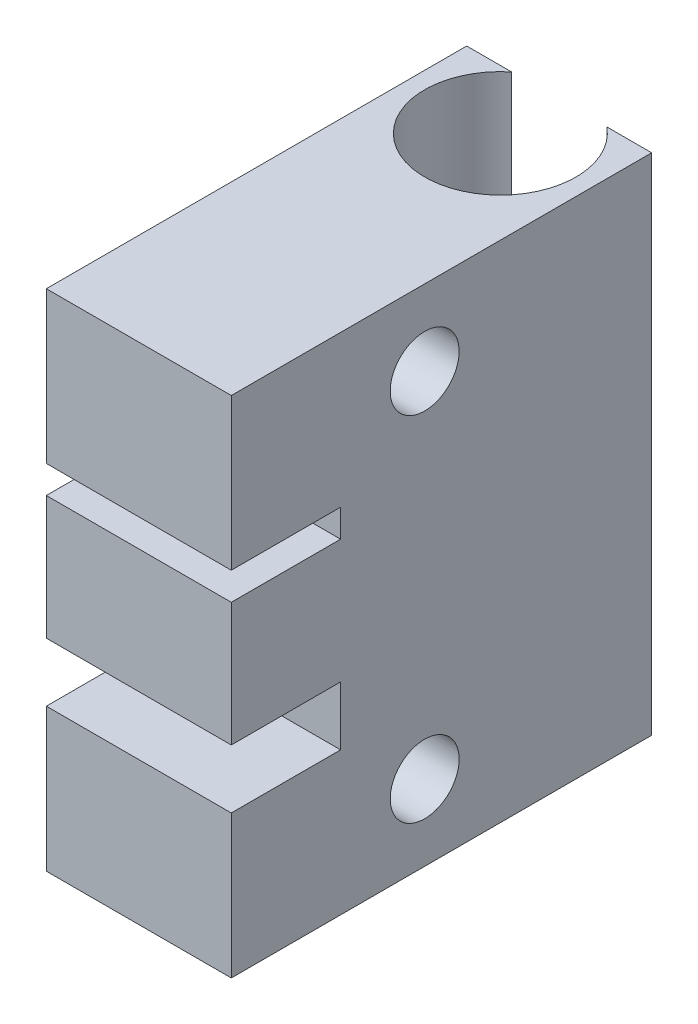
ISO-10303-21;
HEADER;
FILE_DESCRIPTION(('STEP AP214'),'2;1');
FILE_NAME('part.step','',(''),(''),'','','');
FILE_SCHEMA(('AUTOMOTIVE_DESIGN { 1 0 10303 214 1 1 1 1 }'));
ENDSEC;
DATA;
#1=APPLICATION_CONTEXT('core data for automotive mechanical design processes');
#2=APPLICATION_PROTOCOL_DEFINITION('international standard','automotive_design',2000,#1);
#3=PRODUCT_CONTEXT('',#1,'mechanical');
#4=PRODUCT('Part','Part','',(#3));
#5=PRODUCT_RELATED_PRODUCT_CATEGORY('part','',(#4));
#6=PRODUCT_DEFINITION_FORMATION('','',#4);
#7=PRODUCT_DEFINITION_CONTEXT('part definition',#1,'design');
#8=PRODUCT_DEFINITION('design','',#6,#7);
#9=PRODUCT_DEFINITION_SHAPE('','',#8);
#10=(LENGTH_UNIT() NAMED_UNIT(*) SI_UNIT(.MILLI.,.METRE.));
#11=(NAMED_UNIT(*) PLANE_ANGLE_UNIT() SI_UNIT($,.RADIAN.));
#12=(NAMED_UNIT(*) SI_UNIT($,.STERADIAN.) SOLID_ANGLE_UNIT());
#13=UNCERTAINTY_MEASURE_WITH_UNIT(LENGTH_MEASURE(1.E-05),#10,'distance_accuracy_value','');
#14=(GEOMETRIC_REPRESENTATION_CONTEXT(3) GLOBAL_UNCERTAINTY_ASSIGNED_CONTEXT((#13)) GLOBAL_UNIT_ASSIGNED_CONTEXT((#10,
#11,#12)) REPRESENTATION_CONTEXT('',''));
#15=CARTESIAN_POINT('',(0.,0.,0.));
#16=DIRECTION('',(0.,0.,1.));
#17=DIRECTION('',(1.,0.,0.));
#18=AXIS2_PLACEMENT_3D('',#15,#16,#17);
#19=CARTESIAN_POINT('',(11.,60.,25.));
#20=DIRECTION('',(0.,0.,-1.));
#21=DIRECTION('',(-1.,0.,0.));
#22=AXIS2_PLACEMENT_3D('',#19,#20,#21);
#23=PLANE('',#22);
#24=DIRECTION('',(0.,-1.,0.));
#25=VECTOR('',#24,1.);
#26=CARTESIAN_POINT('',(-11.,60.,25.));
#27=LINE('',#26,#25);
#28=CARTESIAN_POINT('',(-11.,38.7,25.));
#29=VERTEX_POINT('',#28);
#30=CARTESIAN_POINT('',(-11.,24.,25.));
#31=VERTEX_POINT('',#30);
#32=EDGE_CURVE('E237',#29,#31,#27,.T.);
#33=ORIENTED_EDGE('',*,*,#32,.T.);
#34=DIRECTION('',(-1.,0.,0.));
#35=VECTOR('',#34,1.);
#36=CARTESIAN_POINT('',(-11.,24.,25.));
#37=LINE('',#36,#35);
#38=CARTESIAN_POINT('',(11.,24.,25.));
#39=VERTEX_POINT('',#38);
#40=EDGE_CURVE('E148',#39,#31,#37,.T.);
#41=ORIENTED_EDGE('',*,*,#40,.F.);
#42=DIRECTION('',(0.,-1.,0.));
#43=VECTOR('',#42,1.);
#44=CARTESIAN_POINT('',(11.,60.,25.));
#45=LINE('',#44,#43);
#46=CARTESIAN_POINT('',(11.,38.7,25.));
#47=VERTEX_POINT('',#46);
#48=EDGE_CURVE('E232',#47,#39,#45,.T.);
#49=ORIENTED_EDGE('',*,*,#48,.F.);
#50=DIRECTION('',(1.,0.,0.));
#51=VECTOR('',#50,1.);
#52=CARTESIAN_POINT('',(-11.,38.7,25.));
#53=LINE('',#52,#51);
#54=EDGE_CURVE('E172',#29,#47,#53,.T.);
#55=ORIENTED_EDGE('',*,*,#54,.F.);
#56=EDGE_LOOP('',(#33,#41,#49,#55));
#57=FACE_BOUND('',#56,.T.);
#58=ADVANCED_FACE('F33',(#57),#23,.F.);
#59=CARTESIAN_POINT('',(-11.,60.,25.));
#60=VERTEX_POINT('',#59);
#61=CARTESIAN_POINT('',(-11.,42.,25.));
#62=VERTEX_POINT('',#61);
#63=EDGE_CURVE('E233',#60,#62,#27,.T.);
#64=ORIENTED_EDGE('',*,*,#63,.T.);
#65=DIRECTION('',(-1.,0.,0.));
#66=VECTOR('',#65,1.);
#67=CARTESIAN_POINT('',(-11.,42.,25.));
#68=LINE('',#67,#66);
#69=CARTESIAN_POINT('',(11.,42.,25.));
#70=VERTEX_POINT('',#69);
#71=EDGE_CURVE('E164',#70,#62,#68,.T.);
#72=ORIENTED_EDGE('',*,*,#71,.F.);
#73=CARTESIAN_POINT('',(11.,60.,25.));
#74=VERTEX_POINT('',#73);
#75=EDGE_CURVE('E229',#74,#70,#45,.T.);
#76=ORIENTED_EDGE('',*,*,#75,.F.);
#77=DIRECTION('',(1.,0.,0.));
#78=VECTOR('',#77,1.);
#79=CARTESIAN_POINT('',(11.,60.,25.));
#80=LINE('',#79,#78);
#81=EDGE_CURVE('E216',#60,#74,#80,.T.);
#82=ORIENTED_EDGE('',*,*,#81,.F.);
#83=EDGE_LOOP('',(#64,#72,#76,#82));
#84=FACE_BOUND('',#83,.T.);
#85=ADVANCED_FACE('F272',(#84),#23,.F.);
#86=CARTESIAN_POINT('',(11.,60.,-25.));
#87=DIRECTION('',(0.,0.,1.));
#88=DIRECTION('',(1.,0.,0.));
#89=AXIS2_PLACEMENT_3D('',#86,#87,#88);
#90=PLANE('',#89);
#91=DIRECTION('',(-1.,0.,0.));
#92=VECTOR('',#91,1.);
#93=CARTESIAN_POINT('',(11.,0.,-25.));
#94=LINE('',#93,#92);
#95=CARTESIAN_POINT('',(11.,0.,-25.));
#96=VERTEX_POINT('',#95);
#97=CARTESIAN_POINT('',(5.65685424949238,0.,-25.));
#98=VERTEX_POINT('',#97);
#99=EDGE_CURVE('E222',#96,#98,#94,.T.);
#100=ORIENTED_EDGE('',*,*,#99,.T.);
#101=DIRECTION('',(0.,1.,0.));
#102=VECTOR('',#101,1.);
#103=CARTESIAN_POINT('',(5.65685424949238,0.,-25.));
#104=LINE('',#103,#102);
#105=CARTESIAN_POINT('',(5.65685424949238,60.,-25.));
#106=VERTEX_POINT('',#105);
#107=EDGE_CURVE('E190',#98,#106,#104,.T.);
#108=ORIENTED_EDGE('',*,*,#107,.T.);
#109=DIRECTION('',(-1.,0.,0.));
#110=VECTOR('',#109,1.);
#111=CARTESIAN_POINT('',(11.,60.,-25.));
#112=LINE('',#111,#110);
#113=CARTESIAN_POINT('',(11.,60.,-25.));
#114=VERTEX_POINT('',#113);
#115=EDGE_CURVE('E211',#114,#106,#112,.T.);
#116=ORIENTED_EDGE('',*,*,#115,.F.);
#117=DIRECTION('',(0.,-1.,0.));
#118=VECTOR('',#117,1.);
#119=CARTESIAN_POINT('',(11.,60.,-25.));
#120=LINE('',#119,#118);
#121=EDGE_CURVE('E41',#114,#96,#120,.T.);
#122=ORIENTED_EDGE('',*,*,#121,.T.);
#123=EDGE_LOOP('',(#100,#108,#116,#122));
#124=FACE_BOUND('',#123,.T.);
#125=ADVANCED_FACE('F242',(#124),#90,.F.);
#126=CARTESIAN_POINT('',(11.,60.,-25.));
#127=DIRECTION('',(-1.,0.,0.));
#128=DIRECTION('',(0.,0.,1.));
#129=AXIS2_PLACEMENT_3D('',#126,#127,#128);
#130=PLANE('',#129);
#131=ORIENTED_EDGE('',*,*,#48,.T.);
#132=DIRECTION('',(0.,0.,1.));
#133=VECTOR('',#132,1.);
#134=CARTESIAN_POINT('',(11.,24.,12.));
#135=LINE('',#134,#133);
#136=CARTESIAN_POINT('',(11.,24.,12.));
#137=VERTEX_POINT('',#136);
#138=EDGE_CURVE('E155',#137,#39,#135,.T.);
#139=ORIENTED_EDGE('',*,*,#138,.F.);
#140=DIRECTION('',(0.,1.,0.));
#141=VECTOR('',#140,1.);
#142=CARTESIAN_POINT('',(11.,24.,12.));
#143=LINE('',#142,#141);
#144=CARTESIAN_POINT('',(11.,17.,12.));
#145=VERTEX_POINT('',#144);
#146=EDGE_CURVE('E138',#145,#137,#143,.T.);
#147=ORIENTED_EDGE('',*,*,#146,.F.);
#148=DIRECTION('',(0.,0.,1.));
#149=VECTOR('',#148,1.);
#150=CARTESIAN_POINT('',(11.,17.,12.));
#151=LINE('',#150,#149);
#152=CARTESIAN_POINT('',(11.,17.,25.));
#153=VERTEX_POINT('',#152);
#154=EDGE_CURVE('E135',#145,#153,#151,.T.);
#155=ORIENTED_EDGE('',*,*,#154,.T.);
#156=CARTESIAN_POINT('',(11.,0.,25.));
#157=VERTEX_POINT('',#156);
#158=EDGE_CURVE('E218',#153,#157,#45,.T.);
#159=ORIENTED_EDGE('',*,*,#158,.T.);
#160=DIRECTION('',(0.,0.,-1.));
#161=VECTOR('',#160,1.);
#162=CARTESIAN_POINT('',(11.,0.,-25.));
#163=LINE('',#162,#161);
#164=EDGE_CURVE('E203',#157,#96,#163,.T.);
#165=ORIENTED_EDGE('',*,*,#164,.T.);
#166=ORIENTED_EDGE('',*,*,#121,.F.);
#167=DIRECTION('',(0.,0.,-1.));
#168=VECTOR('',#167,1.);
#169=CARTESIAN_POINT('',(11.,60.,-25.));
#170=LINE('',#169,#168);
#171=EDGE_CURVE('E206',#74,#114,#170,.T.);
#172=ORIENTED_EDGE('',*,*,#171,.F.);
#173=ORIENTED_EDGE('',*,*,#75,.T.);
#174=DIRECTION('',(0.,0.,1.));
#175=VECTOR('',#174,1.);
#176=CARTESIAN_POINT('',(11.,42.,12.));
#177=LINE('',#176,#175);
#178=CARTESIAN_POINT('',(11.,42.,12.));
#179=VERTEX_POINT('',#178);
#180=EDGE_CURVE('E180',#179,#70,#177,.T.);
#181=ORIENTED_EDGE('',*,*,#180,.F.);
#182=DIRECTION('',(0.,1.,0.));
#183=VECTOR('',#182,1.);
#184=CARTESIAN_POINT('',(11.,42.,12.));
#185=LINE('',#184,#183);
#186=CARTESIAN_POINT('',(11.,38.7,12.));
#187=VERTEX_POINT('',#186);
#188=EDGE_CURVE('E167',#187,#179,#185,.T.);
#189=ORIENTED_EDGE('',*,*,#188,.F.);
#190=DIRECTION('',(0.,0.,1.));
#191=VECTOR('',#190,1.);
#192=CARTESIAN_POINT('',(11.,38.7,12.));
#193=LINE('',#192,#191);
#194=EDGE_CURVE('E182',#187,#47,#193,.T.);
#195=ORIENTED_EDGE('',*,*,#194,.T.);
#196=EDGE_LOOP('',(#131,#139,#147,#155,#159,#165,#166,#172,#173,#181,#189,#195));
#197=FACE_BOUND('',#196,.T.);
#198=CARTESIAN_POINT('',(11.,9.,1.99999999999999));
#199=DIRECTION('',(1.,0.,0.));
#200=DIRECTION('',(0.,0.,-1.));
#201=AXIS2_PLACEMENT_3D('',#198,#199,#200);
#202=CIRCLE('',#201,4.1);
#203=CARTESIAN_POINT('',(11.,9.,-2.10000000000001));
#204=VERTEX_POINT('',#203);
#205=EDGE_CURVE('E193',#204,#204,#202,.T.);
#206=ORIENTED_EDGE('',*,*,#205,.F.);
#207=EDGE_LOOP('',(#206));
#208=FACE_BOUND('',#207,.T.);
#209=CARTESIAN_POINT('',(11.,51.,1.99999999999999));
#210=DIRECTION('',(1.,0.,0.));
#211=DIRECTION('',(0.,0.,-1.));
#212=AXIS2_PLACEMENT_3D('',#209,#210,#211);
#213=CIRCLE('',#212,4.1);
#214=CARTESIAN_POINT('',(11.,51.,-2.10000000000001));
#215=VERTEX_POINT('',#214);
#216=EDGE_CURVE('E197',#215,#215,#213,.T.);
#217=ORIENTED_EDGE('',*,*,#216,.F.);
#218=EDGE_LOOP('',(#217));
#219=FACE_BOUND('',#218,.T.);
#220=ADVANCED_FACE('F35',(#197,#208,#219),#130,.F.);
#221=CARTESIAN_POINT('',(-5.65685424949238,60.,-25.));
#222=VERTEX_POINT('',#221);
#223=CARTESIAN_POINT('',(-11.,60.,-25.));
#224=VERTEX_POINT('',#223);
#225=EDGE_CURVE('E209',#222,#224,#112,.T.);
#226=ORIENTED_EDGE('',*,*,#225,.F.);
#227=DIRECTION('',(0.,1.,0.));
#228=VECTOR('',#227,1.);
#229=CARTESIAN_POINT('',(-5.65685424949238,0.,-25.));
#230=LINE('',#229,#228);
#231=CARTESIAN_POINT('',(-5.65685424949238,0.,-25.));
#232=VERTEX_POINT('',#231);
#233=EDGE_CURVE('E187',#222,#232,#230,.F.);
#234=ORIENTED_EDGE('',*,*,#233,.T.);
#235=CARTESIAN_POINT('',(-11.,0.,-25.));
#236=VERTEX_POINT('',#235);
#237=EDGE_CURVE('E221',#232,#236,#94,.T.);
#238=ORIENTED_EDGE('',*,*,#237,.T.);
#239=DIRECTION('',(0.,-1.,0.));
#240=VECTOR('',#239,1.);
#241=CARTESIAN_POINT('',(-11.,60.,-25.));
#242=LINE('',#241,#240);
#243=EDGE_CURVE('E236',#224,#236,#242,.T.);
#244=ORIENTED_EDGE('',*,*,#243,.F.);
#245=EDGE_LOOP('',(#226,#234,#238,#244));
#246=FACE_BOUND('',#245,.T.);
#247=ADVANCED_FACE('F260',(#246),#90,.F.);
#248=CARTESIAN_POINT('',(-11.,60.,-25.));
#249=DIRECTION('',(1.,0.,0.));
#250=DIRECTION('',(0.,0.,-1.));
#251=AXIS2_PLACEMENT_3D('',#248,#249,#250);
#252=PLANE('',#251);
#253=CARTESIAN_POINT('',(-11.,9.,2.));
#254=DIRECTION('',(1.,0.,0.));
#255=DIRECTION('',(0.,0.,-1.));
#256=AXIS2_PLACEMENT_3D('',#253,#254,#255);
#257=CIRCLE('',#256,4.1);
#258=CARTESIAN_POINT('',(-11.,9.,-2.1));
#259=VERTEX_POINT('',#258);
#260=EDGE_CURVE('E194',#259,#259,#257,.T.);
#261=ORIENTED_EDGE('',*,*,#260,.T.);
#262=EDGE_LOOP('',(#261));
#263=FACE_BOUND('',#262,.T.);
#264=CARTESIAN_POINT('',(-11.,51.,2.));
#265=DIRECTION('',(1.,0.,0.));
#266=DIRECTION('',(0.,0.,-1.));
#267=AXIS2_PLACEMENT_3D('',#264,#265,#266);
#268=CIRCLE('',#267,4.1);
#269=CARTESIAN_POINT('',(-11.,51.,-2.1));
#270=VERTEX_POINT('',#269);
#271=EDGE_CURVE('E200',#270,#270,#268,.T.);
#272=ORIENTED_EDGE('',*,*,#271,.T.);
#273=EDGE_LOOP('',(#272));
#274=FACE_BOUND('',#273,.T.);
#275=DIRECTION('',(0.,-1.,0.));
#276=VECTOR('',#275,1.);
#277=CARTESIAN_POINT('',(-11.,24.,12.));
#278=LINE('',#277,#276);
#279=CARTESIAN_POINT('',(-11.,24.,12.));
#280=VERTEX_POINT('',#279);
#281=CARTESIAN_POINT('',(-11.,17.,12.));
#282=VERTEX_POINT('',#281);
#283=EDGE_CURVE('E139',#280,#282,#278,.T.);
#284=ORIENTED_EDGE('',*,*,#283,.F.);
#285=DIRECTION('',(0.,0.,1.));
#286=VECTOR('',#285,1.);
#287=CARTESIAN_POINT('',(-11.,24.,12.));
#288=LINE('',#287,#286);
#289=EDGE_CURVE('E174',#280,#31,#288,.T.);
#290=ORIENTED_EDGE('',*,*,#289,.T.);
#291=ORIENTED_EDGE('',*,*,#32,.F.);
#292=DIRECTION('',(0.,0.,1.));
#293=VECTOR('',#292,1.);
#294=CARTESIAN_POINT('',(-11.,38.7,12.));
#295=LINE('',#294,#293);
#296=CARTESIAN_POINT('',(-11.,38.7,12.));
#297=VERTEX_POINT('',#296);
#298=EDGE_CURVE('E56',#297,#29,#295,.T.);
#299=ORIENTED_EDGE('',*,*,#298,.F.);
#300=DIRECTION('',(0.,-1.,0.));
#301=VECTOR('',#300,1.);
#302=CARTESIAN_POINT('',(-11.,42.,12.));
#303=LINE('',#302,#301);
#304=CARTESIAN_POINT('',(-11.,42.,12.));
#305=VERTEX_POINT('',#304);
#306=EDGE_CURVE('E160',#305,#297,#303,.T.);
#307=ORIENTED_EDGE('',*,*,#306,.F.);
#308=DIRECTION('',(0.,0.,1.));
#309=VECTOR('',#308,1.);
#310=CARTESIAN_POINT('',(-11.,42.,12.));
#311=LINE('',#310,#309);
#312=EDGE_CURVE('E176',#305,#62,#311,.T.);
#313=ORIENTED_EDGE('',*,*,#312,.T.);
#314=ORIENTED_EDGE('',*,*,#63,.F.);
#315=DIRECTION('',(0.,0.,1.));
#316=VECTOR('',#315,1.);
#317=CARTESIAN_POINT('',(-11.,60.,-25.));
#318=LINE('',#317,#316);
#319=EDGE_CURVE('E214',#224,#60,#318,.T.);
#320=ORIENTED_EDGE('',*,*,#319,.F.);
#321=ORIENTED_EDGE('',*,*,#243,.T.);
#322=DIRECTION('',(0.,0.,1.));
#323=VECTOR('',#322,1.);
#324=CARTESIAN_POINT('',(-11.,0.,-25.));
#325=LINE('',#324,#323);
#326=CARTESIAN_POINT('',(-11.,0.,25.));
#327=VERTEX_POINT('',#326);
#328=EDGE_CURVE('E225',#236,#327,#325,.T.);
#329=ORIENTED_EDGE('',*,*,#328,.T.);
#330=CARTESIAN_POINT('',(-11.,17.,25.));
#331=VERTEX_POINT('',#330);
#332=EDGE_CURVE('E153',#331,#327,#27,.T.);
#333=ORIENTED_EDGE('',*,*,#332,.F.);
#334=DIRECTION('',(0.,0.,1.));
#335=VECTOR('',#334,1.);
#336=CARTESIAN_POINT('',(-11.,17.,12.));
#337=LINE('',#336,#335);
#338=EDGE_CURVE('E48',#282,#331,#337,.T.);
#339=ORIENTED_EDGE('',*,*,#338,.F.);
#340=EDGE_LOOP('',(#284,#290,#291,#299,#307,#313,#314,#320,#321,#329,#333,#339));
#341=FACE_BOUND('',#340,.T.);
#342=ADVANCED_FACE('F151',(#263,#274,#341),#252,.F.);
#343=ORIENTED_EDGE('',*,*,#158,.F.);
#344=DIRECTION('',(1.,0.,0.));
#345=VECTOR('',#344,1.);
#346=CARTESIAN_POINT('',(-11.,17.,25.));
#347=LINE('',#346,#345);
#348=EDGE_CURVE('E286',#331,#153,#347,.T.);
#349=ORIENTED_EDGE('',*,*,#348,.F.);
#350=ORIENTED_EDGE('',*,*,#332,.T.);
#351=DIRECTION('',(1.,0.,0.));
#352=VECTOR('',#351,1.);
#353=CARTESIAN_POINT('',(11.,0.,25.));
#354=LINE('',#353,#352);
#355=EDGE_CURVE('E210',#327,#157,#354,.T.);
#356=ORIENTED_EDGE('',*,*,#355,.T.);
#357=EDGE_LOOP('',(#343,#349,#350,#356));
#358=FACE_BOUND('',#357,.T.);
#359=ADVANCED_FACE('F293',(#358),#23,.F.);
#360=CARTESIAN_POINT('',(11.,60.,25.));
#361=DIRECTION('',(0.,-1.,0.));
#362=DIRECTION('',(0.,0.,-1.));
#363=AXIS2_PLACEMENT_3D('',#360,#361,#362);
#364=PLANE('',#363);
#365=ORIENTED_EDGE('',*,*,#115,.T.);
#366=CARTESIAN_POINT('',(0.,60.,-18.));
#367=DIRECTION('',(0.,1.,0.));
#368=DIRECTION('',(0.,0.,1.));
#369=AXIS2_PLACEMENT_3D('',#366,#367,#368);
#370=CIRCLE('',#369,9.);
#371=EDGE_CURVE('E179',#222,#106,#370,.T.);
#372=ORIENTED_EDGE('',*,*,#371,.F.);
#373=ORIENTED_EDGE('',*,*,#225,.T.);
#374=ORIENTED_EDGE('',*,*,#319,.T.);
#375=ORIENTED_EDGE('',*,*,#81,.T.);
#376=ORIENTED_EDGE('',*,*,#171,.T.);
#377=EDGE_LOOP('',(#365,#372,#373,#374,#375,#376));
#378=FACE_BOUND('',#377,.T.);
#379=ADVANCED_FACE('F264',(#378),#364,.F.);
#380=CARTESIAN_POINT('',(11.,0.,25.));
#381=DIRECTION('',(0.,-1.,0.));
#382=DIRECTION('',(0.,0.,-1.));
#383=AXIS2_PLACEMENT_3D('',#380,#381,#382);
#384=PLANE('',#383);
#385=CARTESIAN_POINT('',(0.,0.,-18.));
#386=DIRECTION('',(0.,-1.,0.));
#387=DIRECTION('',(0.,0.,-1.));
#388=AXIS2_PLACEMENT_3D('',#385,#386,#387);
#389=CIRCLE('',#388,9.);
#390=EDGE_CURVE('E11',#98,#232,#389,.T.);
#391=ORIENTED_EDGE('',*,*,#390,.F.);
#392=ORIENTED_EDGE('',*,*,#99,.F.);
#393=ORIENTED_EDGE('',*,*,#164,.F.);
#394=ORIENTED_EDGE('',*,*,#355,.F.);
#395=ORIENTED_EDGE('',*,*,#328,.F.);
#396=ORIENTED_EDGE('',*,*,#237,.F.);
#397=EDGE_LOOP('',(#391,#392,#393,#394,#395,#396));
#398=FACE_BOUND('',#397,.T.);
#399=ADVANCED_FACE('F252',(#398),#384,.T.);
#400=CARTESIAN_POINT('',(-11.,51.,2.));
#401=DIRECTION('',(1.,0.,0.));
#402=DIRECTION('',(0.,0.,-1.));
#403=AXIS2_PLACEMENT_3D('',#400,#401,#402);
#404=CYLINDRICAL_SURFACE('',#403,4.1);
#405=ORIENTED_EDGE('',*,*,#271,.F.);
#406=EDGE_LOOP('',(#405));
#407=FACE_BOUND('',#406,.T.);
#408=ORIENTED_EDGE('',*,*,#216,.T.);
#409=EDGE_LOOP('',(#408));
#410=FACE_BOUND('',#409,.T.);
#411=ADVANCED_FACE('F389',(#407,#410),#404,.F.);
#412=CARTESIAN_POINT('',(-11.,9.,2.));
#413=DIRECTION('',(1.,0.,0.));
#414=DIRECTION('',(0.,0.,-1.));
#415=AXIS2_PLACEMENT_3D('',#412,#413,#414);
#416=CYLINDRICAL_SURFACE('',#415,4.1);
#417=ORIENTED_EDGE('',*,*,#260,.F.);
#418=EDGE_LOOP('',(#417));
#419=FACE_BOUND('',#418,.T.);
#420=ORIENTED_EDGE('',*,*,#205,.T.);
#421=EDGE_LOOP('',(#420));
#422=FACE_BOUND('',#421,.T.);
#423=ADVANCED_FACE('F386',(#419,#422),#416,.F.);
#424=CARTESIAN_POINT('',(0.,0.,-18.));
#425=DIRECTION('',(0.,1.,0.));
#426=DIRECTION('',(0.,0.,1.));
#427=AXIS2_PLACEMENT_3D('',#424,#425,#426);
#428=CYLINDRICAL_SURFACE('',#427,9.);
#429=ORIENTED_EDGE('',*,*,#390,.T.);
#430=ORIENTED_EDGE('',*,*,#233,.F.);
#431=ORIENTED_EDGE('',*,*,#371,.T.);
#432=ORIENTED_EDGE('',*,*,#107,.F.);
#433=EDGE_LOOP('',(#429,#430,#431,#432));
#434=FACE_BOUND('',#433,.T.);
#435=ADVANCED_FACE('F256',(#434),#428,.F.);
#436=CARTESIAN_POINT('',(-11.,42.,12.));
#437=DIRECTION('',(0.,1.,0.));
#438=DIRECTION('',(0.,0.,1.));
#439=AXIS2_PLACEMENT_3D('',#436,#437,#438);
#440=PLANE('',#439);
#441=ORIENTED_EDGE('',*,*,#71,.T.);
#442=ORIENTED_EDGE('',*,*,#312,.F.);
#443=DIRECTION('',(-1.,0.,0.));
#444=VECTOR('',#443,1.);
#445=CARTESIAN_POINT('',(-11.,42.,12.));
#446=LINE('',#445,#444);
#447=EDGE_CURVE('E169',#179,#305,#446,.T.);
#448=ORIENTED_EDGE('',*,*,#447,.F.);
#449=ORIENTED_EDGE('',*,*,#180,.T.);
#450=EDGE_LOOP('',(#441,#442,#448,#449));
#451=FACE_BOUND('',#450,.T.);
#452=ADVANCED_FACE('F274',(#451),#440,.F.);
#453=CARTESIAN_POINT('',(-11.,38.7,12.));
#454=DIRECTION('',(0.,-1.,0.));
#455=DIRECTION('',(0.,0.,-1.));
#456=AXIS2_PLACEMENT_3D('',#453,#454,#455);
#457=PLANE('',#456);
#458=ORIENTED_EDGE('',*,*,#54,.T.);
#459=ORIENTED_EDGE('',*,*,#194,.F.);
#460=DIRECTION('',(1.,0.,0.));
#461=VECTOR('',#460,1.);
#462=CARTESIAN_POINT('',(-11.,38.7,12.));
#463=LINE('',#462,#461);
#464=EDGE_CURVE('E163',#297,#187,#463,.T.);
#465=ORIENTED_EDGE('',*,*,#464,.F.);
#466=ORIENTED_EDGE('',*,*,#298,.T.);
#467=EDGE_LOOP('',(#458,#459,#465,#466));
#468=FACE_BOUND('',#467,.T.);
#469=ADVANCED_FACE('F338',(#468),#457,.F.);
#470=CARTESIAN_POINT('',(0.,0.,12.));
#471=DIRECTION('',(0.,0.,1.));
#472=DIRECTION('',(1.,0.,0.));
#473=AXIS2_PLACEMENT_3D('',#470,#471,#472);
#474=PLANE('',#473);
#475=ORIENTED_EDGE('',*,*,#306,.T.);
#476=ORIENTED_EDGE('',*,*,#464,.T.);
#477=ORIENTED_EDGE('',*,*,#188,.T.);
#478=ORIENTED_EDGE('',*,*,#447,.T.);
#479=EDGE_LOOP('',(#475,#476,#477,#478));
#480=FACE_BOUND('',#479,.T.);
#481=ADVANCED_FACE('F279',(#480),#474,.T.);
#482=CARTESIAN_POINT('',(-11.,24.,12.));
#483=DIRECTION('',(0.,1.,0.));
#484=DIRECTION('',(0.,0.,1.));
#485=AXIS2_PLACEMENT_3D('',#482,#483,#484);
#486=PLANE('',#485);
#487=ORIENTED_EDGE('',*,*,#40,.T.);
#488=ORIENTED_EDGE('',*,*,#289,.F.);
#489=DIRECTION('',(-1.,0.,0.));
#490=VECTOR('',#489,1.);
#491=CARTESIAN_POINT('',(-11.,24.,12.));
#492=LINE('',#491,#490);
#493=EDGE_CURVE('E145',#137,#280,#492,.T.);
#494=ORIENTED_EDGE('',*,*,#493,.F.);
#495=ORIENTED_EDGE('',*,*,#138,.T.);
#496=EDGE_LOOP('',(#487,#488,#494,#495));
#497=FACE_BOUND('',#496,.T.);
#498=ADVANCED_FACE('F290',(#497),#486,.F.);
#499=CARTESIAN_POINT('',(-11.,17.,12.));
#500=DIRECTION('',(0.,-1.,0.));
#501=DIRECTION('',(0.,0.,-1.));
#502=AXIS2_PLACEMENT_3D('',#499,#500,#501);
#503=PLANE('',#502);
#504=ORIENTED_EDGE('',*,*,#348,.T.);
#505=ORIENTED_EDGE('',*,*,#154,.F.);
#506=DIRECTION('',(1.,0.,0.));
#507=VECTOR('',#506,1.);
#508=CARTESIAN_POINT('',(-11.,17.,12.));
#509=LINE('',#508,#507);
#510=EDGE_CURVE('E131',#282,#145,#509,.T.);
#511=ORIENTED_EDGE('',*,*,#510,.F.);
#512=ORIENTED_EDGE('',*,*,#338,.T.);
#513=EDGE_LOOP('',(#504,#505,#511,#512));
#514=FACE_BOUND('',#513,.T.);
#515=ADVANCED_FACE('F133',(#514),#503,.F.);
#516=CARTESIAN_POINT('',(0.,0.,12.));
#517=DIRECTION('',(0.,0.,1.));
#518=DIRECTION('',(1.,0.,0.));
#519=AXIS2_PLACEMENT_3D('',#516,#517,#518);
#520=PLANE('',#519);
#521=ORIENTED_EDGE('',*,*,#283,.T.);
#522=ORIENTED_EDGE('',*,*,#510,.T.);
#523=ORIENTED_EDGE('',*,*,#146,.T.);
#524=ORIENTED_EDGE('',*,*,#493,.T.);
#525=EDGE_LOOP('',(#521,#522,#523,#524));
#526=FACE_BOUND('',#525,.T.);
#527=ADVANCED_FACE('F143',(#526),#520,.T.);
#528=CLOSED_SHELL('',(#58,#85,#125,#220,#247,#342,#359,#379,#399,#411,#423,#435,#452,#469,#481,
#498,#515,#527));
#529=MANIFOLD_SOLID_BREP('B2',#528);
#530=ADVANCED_BREP_SHAPE_REPRESENTATION('',(#18,#529),#14);
#531=SHAPE_DEFINITION_REPRESENTATION(#9,#530);
ENDSEC;
END-ISO-10303-21;
